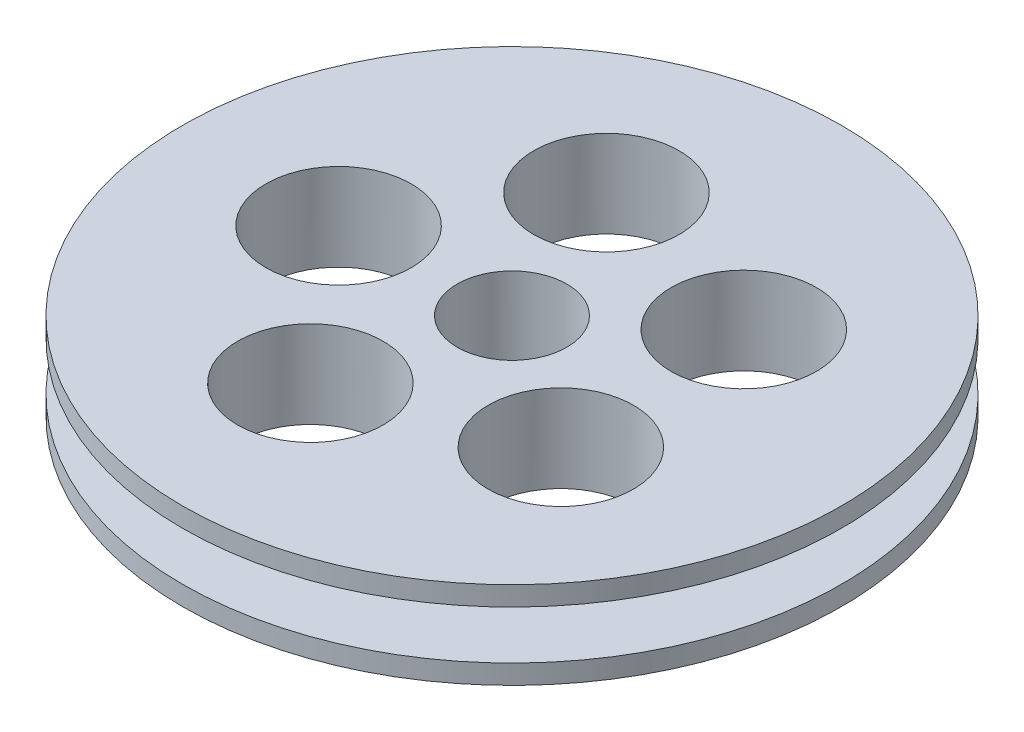
ISO-10303-21;
HEADER;
FILE_DESCRIPTION(('STEP AP214'),'2;1');
FILE_NAME('part.step','',(''),(''),'','','');
FILE_SCHEMA(('AUTOMOTIVE_DESIGN { 1 0 10303 214 1 1 1 1 }'));
ENDSEC;
DATA;
#1=APPLICATION_CONTEXT('core data for automotive mechanical design processes');
#2=APPLICATION_PROTOCOL_DEFINITION('international standard','automotive_design',2000,#1);
#3=PRODUCT_CONTEXT('',#1,'mechanical');
#4=PRODUCT('Part','Part','',(#3));
#5=PRODUCT_RELATED_PRODUCT_CATEGORY('part','',(#4));
#6=PRODUCT_DEFINITION_FORMATION('','',#4);
#7=PRODUCT_DEFINITION_CONTEXT('part definition',#1,'design');
#8=PRODUCT_DEFINITION('design','',#6,#7);
#9=PRODUCT_DEFINITION_SHAPE('','',#8);
#10=(LENGTH_UNIT() NAMED_UNIT(*) SI_UNIT(.MILLI.,.METRE.));
#11=(NAMED_UNIT(*) PLANE_ANGLE_UNIT() SI_UNIT($,.RADIAN.));
#12=(NAMED_UNIT(*) SI_UNIT($,.STERADIAN.) SOLID_ANGLE_UNIT());
#13=UNCERTAINTY_MEASURE_WITH_UNIT(LENGTH_MEASURE(1.E-05),#10,'distance_accuracy_value','');
#14=(GEOMETRIC_REPRESENTATION_CONTEXT(3) GLOBAL_UNCERTAINTY_ASSIGNED_CONTEXT((#13)) GLOBAL_UNIT_ASSIGNED_CONTEXT((#10,
#11,#12)) REPRESENTATION_CONTEXT('',''));
#15=CARTESIAN_POINT('',(0.,0.,0.));
#16=DIRECTION('',(0.,0.,1.));
#17=DIRECTION('',(1.,0.,0.));
#18=AXIS2_PLACEMENT_3D('',#15,#16,#17);
#19=CARTESIAN_POINT('',(0.,5.,0.));
#20=DIRECTION('',(0.,-1.,0.));
#21=DIRECTION('',(0.,0.,-1.));
#22=AXIS2_PLACEMENT_3D('',#19,#20,#21);
#23=PLANE('',#22);
#24=CARTESIAN_POINT('',(0.,5.,4.));
#25=DIRECTION('',(0.,-1.,0.));
#26=DIRECTION('',(0.,0.,-1.));
#27=AXIS2_PLACEMENT_3D('',#24,#25,#26);
#28=CIRCLE('',#27,34.);
#29=CARTESIAN_POINT('',(0.,5.,-30.));
#30=VERTEX_POINT('',#29);
#31=EDGE_CURVE('E10',#30,#30,#28,.T.);
#32=ORIENTED_EDGE('',*,*,#31,.T.);
#33=EDGE_LOOP('',(#32));
#34=FACE_BOUND('',#33,.T.);
#35=CARTESIAN_POINT('',(0.,5.,4.));
#36=DIRECTION('',(0.,-1.,0.));
#37=DIRECTION('',(0.,0.,-1.));
#38=AXIS2_PLACEMENT_3D('',#35,#36,#37);
#39=CIRCLE('',#38,26.);
#40=CARTESIAN_POINT('',(0.,5.,-22.));
#41=VERTEX_POINT('',#40);
#42=EDGE_CURVE('E83',#41,#41,#39,.T.);
#43=ORIENTED_EDGE('',*,*,#42,.F.);
#44=EDGE_LOOP('',(#43));
#45=FACE_BOUND('',#44,.T.);
#46=ADVANCED_FACE('F42',(#34,#45),#23,.T.);
#47=CARTESIAN_POINT('',(0.,2.5,4.));
#48=DIRECTION('',(0.,-1.,0.));
#49=DIRECTION('',(0.,0.,-1.));
#50=AXIS2_PLACEMENT_3D('',#47,#48,#49);
#51=CYLINDRICAL_SURFACE('',#50,34.);
#52=CARTESIAN_POINT('',(0.,7.,4.));
#53=DIRECTION('',(0.,-1.,0.));
#54=DIRECTION('',(0.,0.,-1.));
#55=AXIS2_PLACEMENT_3D('',#52,#53,#54);
#56=CIRCLE('',#55,34.);
#57=CARTESIAN_POINT('',(0.,7.,-30.));
#58=VERTEX_POINT('',#57);
#59=EDGE_CURVE('E50',#58,#58,#56,.T.);
#60=ORIENTED_EDGE('',*,*,#59,.T.);
#61=EDGE_LOOP('',(#60));
#62=FACE_BOUND('',#61,.T.);
#63=ORIENTED_EDGE('',*,*,#31,.F.);
#64=EDGE_LOOP('',(#63));
#65=FACE_BOUND('',#64,.T.);
#66=ADVANCED_FACE('F130',(#62,#65),#51,.T.);
#67=CARTESIAN_POINT('',(0.,7.,0.));
#68=DIRECTION('',(0.,-1.,0.));
#69=DIRECTION('',(0.,0.,-1.));
#70=AXIS2_PLACEMENT_3D('',#67,#68,#69);
#71=PLANE('',#70);
#72=CARTESIAN_POINT('',(-16.9752186457176,7.,4.91757938625501));
#73=DIRECTION('',(0.,1.,0.));
#74=DIRECTION('',(0.,0.,1.));
#75=AXIS2_PLACEMENT_3D('',#72,#73,#74);
#76=CIRCLE('',#75,7.5);
#77=CARTESIAN_POINT('',(-16.9752186457176,7.,12.417579386255));
#78=VERTEX_POINT('',#77);
#79=EDGE_CURVE('E162',#78,#78,#76,.T.);
#80=ORIENTED_EDGE('',*,*,#79,.F.);
#81=EDGE_LOOP('',(#80));
#82=FACE_BOUND('',#81,.T.);
#83=CARTESIAN_POINT('',(-6.11830089927317,7.,-11.8608446845038));
#84=DIRECTION('',(0.,1.,0.));
#85=DIRECTION('',(0.,0.,1.));
#86=AXIS2_PLACEMENT_3D('',#83,#84,#85);
#87=CIRCLE('',#86,7.5);
#88=CARTESIAN_POINT('',(-6.11830089927317,7.,-4.36084468450383));
#89=VERTEX_POINT('',#88);
#90=EDGE_CURVE('E165',#89,#89,#87,.T.);
#91=ORIENTED_EDGE('',*,*,#90,.F.);
#92=EDGE_LOOP('',(#91));
#93=FACE_BOUND('',#92,.T.);
#94=CARTESIAN_POINT('',(13.1939007365678,7.,-6.72012049156148));
#95=DIRECTION('',(0.,1.,0.));
#96=DIRECTION('',(0.,0.,1.));
#97=AXIS2_PLACEMENT_3D('',#94,#95,#96);
#98=CIRCLE('',#97,7.5);
#99=CARTESIAN_POINT('',(13.1939007365678,7.,0.779879508438518));
#100=VERTEX_POINT('',#99);
#101=EDGE_CURVE('E171',#100,#100,#98,.T.);
#102=ORIENTED_EDGE('',*,*,#101,.F.);
#103=EDGE_LOOP('',(#102));
#104=FACE_BOUND('',#103,.T.);
#105=CARTESIAN_POINT('',(14.2725799986643,7.,13.2354458572246));
#106=DIRECTION('',(0.,1.,0.));
#107=DIRECTION('',(0.,0.,1.));
#108=AXIS2_PLACEMENT_3D('',#105,#106,#107);
#109=CIRCLE('',#108,7.49999999999999);
#110=CARTESIAN_POINT('',(14.2725799986643,7.,20.7354458572246));
#111=VERTEX_POINT('',#110);
#112=EDGE_CURVE('E178',#111,#111,#109,.T.);
#113=ORIENTED_EDGE('',*,*,#112,.F.);
#114=EDGE_LOOP('',(#113));
#115=FACE_BOUND('',#114,.T.);
#116=CARTESIAN_POINT('',(-4.3729611902413,7.,20.4279399325857));
#117=DIRECTION('',(0.,1.,0.));
#118=DIRECTION('',(0.,0.,1.));
#119=AXIS2_PLACEMENT_3D('',#116,#117,#118);
#120=CIRCLE('',#119,7.5);
#121=CARTESIAN_POINT('',(-4.3729611902413,7.,27.9279399325857));
#122=VERTEX_POINT('',#121);
#123=EDGE_CURVE('E174',#122,#122,#120,.T.);
#124=ORIENTED_EDGE('',*,*,#123,.F.);
#125=EDGE_LOOP('',(#124));
#126=FACE_BOUND('',#125,.T.);
#127=CARTESIAN_POINT('',(0.,7.,4.));
#128=DIRECTION('',(0.,1.,0.));
#129=DIRECTION('',(0.,0.,1.));
#130=AXIS2_PLACEMENT_3D('',#127,#128,#129);
#131=CIRCLE('',#130,5.65374986428274);
#132=CARTESIAN_POINT('',(0.,7.,9.65374986428274));
#133=VERTEX_POINT('',#132);
#134=EDGE_CURVE('E65',#133,#133,#131,.T.);
#135=ORIENTED_EDGE('',*,*,#134,.F.);
#136=EDGE_LOOP('',(#135));
#137=FACE_BOUND('',#136,.T.);
#138=ORIENTED_EDGE('',*,*,#59,.F.);
#139=EDGE_LOOP('',(#138));
#140=FACE_BOUND('',#139,.T.);
#141=ADVANCED_FACE('F134',(#82,#93,#104,#115,#126,#137,#140),#71,.F.);
#142=CARTESIAN_POINT('',(0.,-2.,0.));
#143=DIRECTION('',(0.,-1.,0.));
#144=DIRECTION('',(0.,0.,-1.));
#145=AXIS2_PLACEMENT_3D('',#142,#143,#144);
#146=PLANE('',#145);
#147=CARTESIAN_POINT('',(-16.9752186457176,-2.,4.91757938625501));
#148=DIRECTION('',(0.,-1.,0.));
#149=DIRECTION('',(0.,0.,-1.));
#150=AXIS2_PLACEMENT_3D('',#147,#148,#149);
#151=CIRCLE('',#150,7.5);
#152=CARTESIAN_POINT('',(-16.9752186457176,-2.,-2.58242061374499));
#153=VERTEX_POINT('',#152);
#154=EDGE_CURVE('E45',#153,#153,#151,.T.);
#155=ORIENTED_EDGE('',*,*,#154,.F.);
#156=EDGE_LOOP('',(#155));
#157=FACE_BOUND('',#156,.T.);
#158=CARTESIAN_POINT('',(-6.11830089927317,-2.,-11.8608446845038));
#159=DIRECTION('',(0.,-1.,0.));
#160=DIRECTION('',(0.,0.,-1.));
#161=AXIS2_PLACEMENT_3D('',#158,#159,#160);
#162=CIRCLE('',#161,7.5);
#163=CARTESIAN_POINT('',(-6.11830089927317,-2.,-19.3608446845038));
#164=VERTEX_POINT('',#163);
#165=EDGE_CURVE('E76',#164,#164,#162,.T.);
#166=ORIENTED_EDGE('',*,*,#165,.F.);
#167=EDGE_LOOP('',(#166));
#168=FACE_BOUND('',#167,.T.);
#169=CARTESIAN_POINT('',(13.1939007365678,-2.,-6.72012049156148));
#170=DIRECTION('',(0.,-1.,0.));
#171=DIRECTION('',(0.,0.,-1.));
#172=AXIS2_PLACEMENT_3D('',#169,#170,#171);
#173=CIRCLE('',#172,7.5);
#174=CARTESIAN_POINT('',(13.1939007365678,-2.,-14.2201204915615));
#175=VERTEX_POINT('',#174);
#176=EDGE_CURVE('E73',#175,#175,#173,.T.);
#177=ORIENTED_EDGE('',*,*,#176,.F.);
#178=EDGE_LOOP('',(#177));
#179=FACE_BOUND('',#178,.T.);
#180=CARTESIAN_POINT('',(14.2725799986643,-2.,13.2354458572246));
#181=DIRECTION('',(0.,-1.,0.));
#182=DIRECTION('',(0.,0.,-1.));
#183=AXIS2_PLACEMENT_3D('',#180,#181,#182);
#184=CIRCLE('',#183,7.49999999999999);
#185=CARTESIAN_POINT('',(14.2725799986643,-2.,5.73544585722461));
#186=VERTEX_POINT('',#185);
#187=EDGE_CURVE('E69',#186,#186,#184,.T.);
#188=ORIENTED_EDGE('',*,*,#187,.F.);
#189=EDGE_LOOP('',(#188));
#190=FACE_BOUND('',#189,.T.);
#191=CARTESIAN_POINT('',(-4.3729611902413,-2.,20.4279399325857));
#192=DIRECTION('',(0.,-1.,0.));
#193=DIRECTION('',(0.,0.,-1.));
#194=AXIS2_PLACEMENT_3D('',#191,#192,#193);
#195=CIRCLE('',#194,7.5);
#196=CARTESIAN_POINT('',(-4.3729611902413,-2.,12.9279399325857));
#197=VERTEX_POINT('',#196);
#198=EDGE_CURVE('E64',#197,#197,#195,.T.);
#199=ORIENTED_EDGE('',*,*,#198,.F.);
#200=EDGE_LOOP('',(#199));
#201=FACE_BOUND('',#200,.T.);
#202=CARTESIAN_POINT('',(0.,-2.,4.));
#203=DIRECTION('',(0.,-1.,0.));
#204=DIRECTION('',(0.,0.,-1.));
#205=AXIS2_PLACEMENT_3D('',#202,#203,#204);
#206=CIRCLE('',#205,5.65374986428274);
#207=CARTESIAN_POINT('',(0.,-2.,-1.65374986428274));
#208=VERTEX_POINT('',#207);
#209=EDGE_CURVE('E60',#208,#208,#206,.T.);
#210=ORIENTED_EDGE('',*,*,#209,.F.);
#211=EDGE_LOOP('',(#210));
#212=FACE_BOUND('',#211,.T.);
#213=CARTESIAN_POINT('',(0.,-2.,4.));
#214=DIRECTION('',(0.,-1.,0.));
#215=DIRECTION('',(0.,0.,-1.));
#216=AXIS2_PLACEMENT_3D('',#213,#214,#215);
#217=CIRCLE('',#216,34.);
#218=CARTESIAN_POINT('',(0.,-2.,-30.));
#219=VERTEX_POINT('',#218);
#220=EDGE_CURVE('E56',#219,#219,#217,.T.);
#221=ORIENTED_EDGE('',*,*,#220,.T.);
#222=EDGE_LOOP('',(#221));
#223=FACE_BOUND('',#222,.T.);
#224=ADVANCED_FACE('F105',(#157,#168,#179,#190,#201,#212,#223),#146,.T.);
#225=CARTESIAN_POINT('',(0.,2.5,4.));
#226=DIRECTION('',(0.,-1.,0.));
#227=DIRECTION('',(0.,0.,-1.));
#228=AXIS2_PLACEMENT_3D('',#225,#226,#227);
#229=CYLINDRICAL_SURFACE('',#228,34.);
#230=ORIENTED_EDGE('',*,*,#220,.F.);
#231=EDGE_LOOP('',(#230));
#232=FACE_BOUND('',#231,.T.);
#233=CARTESIAN_POINT('',(0.,0.,4.));
#234=DIRECTION('',(0.,-1.,0.));
#235=DIRECTION('',(0.,0.,-1.));
#236=AXIS2_PLACEMENT_3D('',#233,#234,#235);
#237=CIRCLE('',#236,34.);
#238=CARTESIAN_POINT('',(0.,0.,-30.));
#239=VERTEX_POINT('',#238);
#240=EDGE_CURVE('E94',#239,#239,#237,.T.);
#241=ORIENTED_EDGE('',*,*,#240,.T.);
#242=EDGE_LOOP('',(#241));
#243=FACE_BOUND('',#242,.T.);
#244=ADVANCED_FACE('F107',(#232,#243),#229,.T.);
#245=CARTESIAN_POINT('',(0.,0.,0.));
#246=DIRECTION('',(0.,-1.,0.));
#247=DIRECTION('',(0.,0.,-1.));
#248=AXIS2_PLACEMENT_3D('',#245,#246,#247);
#249=PLANE('',#248);
#250=ORIENTED_EDGE('',*,*,#240,.F.);
#251=EDGE_LOOP('',(#250));
#252=FACE_BOUND('',#251,.T.);
#253=CARTESIAN_POINT('',(0.,0.,4.));
#254=DIRECTION('',(0.,-1.,0.));
#255=DIRECTION('',(0.,0.,-1.));
#256=AXIS2_PLACEMENT_3D('',#253,#254,#255);
#257=CIRCLE('',#256,26.);
#258=CARTESIAN_POINT('',(0.,0.,-22.));
#259=VERTEX_POINT('',#258);
#260=EDGE_CURVE('E88',#259,#259,#257,.T.);
#261=ORIENTED_EDGE('',*,*,#260,.T.);
#262=EDGE_LOOP('',(#261));
#263=FACE_BOUND('',#262,.T.);
#264=ADVANCED_FACE('F110',(#252,#263),#249,.F.);
#265=CARTESIAN_POINT('',(0.,2.5,4.));
#266=DIRECTION('',(0.,-1.,0.));
#267=DIRECTION('',(0.,0.,-1.));
#268=AXIS2_PLACEMENT_3D('',#265,#266,#267);
#269=CYLINDRICAL_SURFACE('',#268,26.);
#270=ORIENTED_EDGE('',*,*,#42,.T.);
#271=EDGE_LOOP('',(#270));
#272=FACE_BOUND('',#271,.T.);
#273=ORIENTED_EDGE('',*,*,#260,.F.);
#274=EDGE_LOOP('',(#273));
#275=FACE_BOUND('',#274,.T.);
#276=ADVANCED_FACE('F116',(#272,#275),#269,.T.);
#277=CARTESIAN_POINT('',(0.,-3.,4.));
#278=DIRECTION('',(0.,1.,0.));
#279=DIRECTION('',(0.,0.,1.));
#280=AXIS2_PLACEMENT_3D('',#277,#278,#279);
#281=CYLINDRICAL_SURFACE('',#280,5.65374986428274);
#282=ORIENTED_EDGE('',*,*,#209,.T.);
#283=EDGE_LOOP('',(#282));
#284=FACE_BOUND('',#283,.T.);
#285=ORIENTED_EDGE('',*,*,#134,.T.);
#286=EDGE_LOOP('',(#285));
#287=FACE_BOUND('',#286,.T.);
#288=ADVANCED_FACE('F121',(#284,#287),#281,.F.);
#289=CARTESIAN_POINT('',(-4.3729611902413,-3.,20.4279399325857));
#290=DIRECTION('',(0.,1.,0.));
#291=DIRECTION('',(0.,0.,1.));
#292=AXIS2_PLACEMENT_3D('',#289,#290,#291);
#293=CYLINDRICAL_SURFACE('',#292,7.5);
#294=ORIENTED_EDGE('',*,*,#198,.T.);
#295=EDGE_LOOP('',(#294));
#296=FACE_BOUND('',#295,.T.);
#297=ORIENTED_EDGE('',*,*,#123,.T.);
#298=EDGE_LOOP('',(#297));
#299=FACE_BOUND('',#298,.T.);
#300=ADVANCED_FACE('F126',(#296,#299),#293,.F.);
#301=CARTESIAN_POINT('',(14.2725799986643,-3.,13.2354458572246));
#302=DIRECTION('',(0.,1.,0.));
#303=DIRECTION('',(0.,0.,1.));
#304=AXIS2_PLACEMENT_3D('',#301,#302,#303);
#305=CYLINDRICAL_SURFACE('',#304,7.49999999999999);
#306=ORIENTED_EDGE('',*,*,#187,.T.);
#307=EDGE_LOOP('',(#306));
#308=FACE_BOUND('',#307,.T.);
#309=ORIENTED_EDGE('',*,*,#112,.T.);
#310=EDGE_LOOP('',(#309));
#311=FACE_BOUND('',#310,.T.);
#312=ADVANCED_FACE('F191',(#308,#311),#305,.F.);
#313=CARTESIAN_POINT('',(13.1939007365678,-3.,-6.72012049156148));
#314=DIRECTION('',(0.,1.,0.));
#315=DIRECTION('',(0.,0.,1.));
#316=AXIS2_PLACEMENT_3D('',#313,#314,#315);
#317=CYLINDRICAL_SURFACE('',#316,7.5);
#318=ORIENTED_EDGE('',*,*,#176,.T.);
#319=EDGE_LOOP('',(#318));
#320=FACE_BOUND('',#319,.T.);
#321=ORIENTED_EDGE('',*,*,#101,.T.);
#322=EDGE_LOOP('',(#321));
#323=FACE_BOUND('',#322,.T.);
#324=ADVANCED_FACE('F197',(#320,#323),#317,.F.);
#325=CARTESIAN_POINT('',(-6.11830089927317,-3.,-11.8608446845038));
#326=DIRECTION('',(0.,1.,0.));
#327=DIRECTION('',(0.,0.,1.));
#328=AXIS2_PLACEMENT_3D('',#325,#326,#327);
#329=CYLINDRICAL_SURFACE('',#328,7.5);
#330=ORIENTED_EDGE('',*,*,#165,.T.);
#331=EDGE_LOOP('',(#330));
#332=FACE_BOUND('',#331,.T.);
#333=ORIENTED_EDGE('',*,*,#90,.T.);
#334=EDGE_LOOP('',(#333));
#335=FACE_BOUND('',#334,.T.);
#336=ADVANCED_FACE('F204',(#332,#335),#329,.F.);
#337=CARTESIAN_POINT('',(-16.9752186457176,-3.,4.91757938625501));
#338=DIRECTION('',(0.,1.,0.));
#339=DIRECTION('',(0.,0.,1.));
#340=AXIS2_PLACEMENT_3D('',#337,#338,#339);
#341=CYLINDRICAL_SURFACE('',#340,7.5);
#342=ORIENTED_EDGE('',*,*,#154,.T.);
#343=EDGE_LOOP('',(#342));
#344=FACE_BOUND('',#343,.T.);
#345=ORIENTED_EDGE('',*,*,#79,.T.);
#346=EDGE_LOOP('',(#345));
#347=FACE_BOUND('',#346,.T.);
#348=ADVANCED_FACE('F201',(#344,#347),#341,.F.);
#349=CLOSED_SHELL('',(#46,#66,#141,#224,#244,#264,#276,#288,#300,#312,#324,#336,#348));
#350=MANIFOLD_SOLID_BREP('B2',#349);
#351=ADVANCED_BREP_SHAPE_REPRESENTATION('',(#18,#350),#14);
#352=SHAPE_DEFINITION_REPRESENTATION(#9,#351);
ENDSEC;
END-ISO-10303-21;
